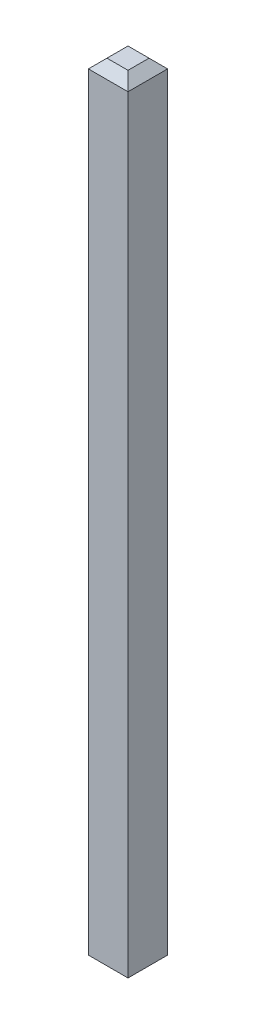
ISO-10303-21;
HEADER;
FILE_DESCRIPTION(('STEP AP214'),'2;1');
FILE_NAME('part.step','',(''),(''),'','','');
FILE_SCHEMA(('AUTOMOTIVE_DESIGN { 1 0 10303 214 1 1 1 1 }'));
ENDSEC;
DATA;
#1=APPLICATION_CONTEXT('core data for automotive mechanical design processes');
#2=APPLICATION_PROTOCOL_DEFINITION('international standard','automotive_design',2000,#1);
#3=PRODUCT_CONTEXT('',#1,'mechanical');
#4=PRODUCT('Part','Part','',(#3));
#5=PRODUCT_RELATED_PRODUCT_CATEGORY('part','',(#4));
#6=PRODUCT_DEFINITION_FORMATION('','',#4);
#7=PRODUCT_DEFINITION_CONTEXT('part definition',#1,'design');
#8=PRODUCT_DEFINITION('design','',#6,#7);
#9=PRODUCT_DEFINITION_SHAPE('','',#8);
#10=(LENGTH_UNIT() NAMED_UNIT(*) SI_UNIT(.MILLI.,.METRE.));
#11=(NAMED_UNIT(*) PLANE_ANGLE_UNIT() SI_UNIT($,.RADIAN.));
#12=(NAMED_UNIT(*) SI_UNIT($,.STERADIAN.) SOLID_ANGLE_UNIT());
#13=UNCERTAINTY_MEASURE_WITH_UNIT(LENGTH_MEASURE(1.E-05),#10,'distance_accuracy_value','');
#14=(GEOMETRIC_REPRESENTATION_CONTEXT(3) GLOBAL_UNCERTAINTY_ASSIGNED_CONTEXT((#13)) GLOBAL_UNIT_ASSIGNED_CONTEXT((#10,
#11,#12)) REPRESENTATION_CONTEXT('',''));
#15=CARTESIAN_POINT('',(0.,0.,0.));
#16=DIRECTION('',(0.,0.,1.));
#17=DIRECTION('',(1.,0.,0.));
#18=AXIS2_PLACEMENT_3D('',#15,#16,#17);
#19=CARTESIAN_POINT('',(0.16,-1.925,-0.245));
#20=DIRECTION('',(0.,-0.707106781186547,-0.707106781186548));
#21=DIRECTION('',(0.,0.707106781186548,-0.707106781186547));
#22=AXIS2_PLACEMENT_3D('',#19,#20,#21);
#23=PLANE('',#22);
#24=DIRECTION('',(-1.,0.,0.));
#25=VECTOR('',#24,1.);
#26=CARTESIAN_POINT('',(0.32,-1.85,-0.32));
#27=LINE('',#26,#25);
#28=CARTESIAN_POINT('',(0.32,-1.85,-0.32));
#29=VERTEX_POINT('',#28);
#30=CARTESIAN_POINT('',(-0.32,-1.85,-0.32));
#31=VERTEX_POINT('',#30);
#32=EDGE_CURVE('E96',#29,#31,#27,.T.);
#33=ORIENTED_EDGE('',*,*,#32,.F.);
#34=DIRECTION('',(0.577350269189625,0.577350269189626,-0.577350269189626));
#35=VECTOR('',#34,1.);
#36=CARTESIAN_POINT('',(0.17,-2.,-0.17));
#37=LINE('',#36,#35);
#38=CARTESIAN_POINT('',(0.17,-2.,-0.17));
#39=VERTEX_POINT('',#38);
#40=EDGE_CURVE('E94',#39,#29,#37,.T.);
#41=ORIENTED_EDGE('',*,*,#40,.F.);
#42=DIRECTION('',(1.,0.,0.));
#43=VECTOR('',#42,1.);
#44=CARTESIAN_POINT('',(0.,-2.,-0.17));
#45=LINE('',#44,#43);
#46=CARTESIAN_POINT('',(-0.17,-2.,-0.17));
#47=VERTEX_POINT('',#46);
#48=EDGE_CURVE('E20',#39,#47,#45,.F.);
#49=ORIENTED_EDGE('',*,*,#48,.T.);
#50=DIRECTION('',(0.577350269189625,-0.577350269189626,0.577350269189626));
#51=VECTOR('',#50,1.);
#52=CARTESIAN_POINT('',(-0.32,-1.85,-0.32));
#53=LINE('',#52,#51);
#54=EDGE_CURVE('E112',#31,#47,#53,.T.);
#55=ORIENTED_EDGE('',*,*,#54,.F.);
#56=EDGE_LOOP('',(#33,#41,#49,#55));
#57=FACE_BOUND('',#56,.T.);
#58=ADVANCED_FACE('F17',(#57),#23,.T.);
#59=CARTESIAN_POINT('',(0.16,10.625,-0.245));
#60=DIRECTION('',(0.,0.70710678118655,-0.707106781186545));
#61=DIRECTION('',(0.,0.707106781186545,0.70710678118655));
#62=AXIS2_PLACEMENT_3D('',#59,#60,#61);
#63=PLANE('',#62);
#64=DIRECTION('',(-1.,0.,0.));
#65=VECTOR('',#64,1.);
#66=CARTESIAN_POINT('',(0.32,10.55,-0.32));
#67=LINE('',#66,#65);
#68=CARTESIAN_POINT('',(-0.32,10.55,-0.32));
#69=VERTEX_POINT('',#68);
#70=CARTESIAN_POINT('',(0.32,10.55,-0.32));
#71=VERTEX_POINT('',#70);
#72=EDGE_CURVE('E121',#69,#71,#67,.F.);
#73=ORIENTED_EDGE('',*,*,#72,.F.);
#74=DIRECTION('',(-0.577350269189627,-0.577350269189623,-0.577350269189627));
#75=VECTOR('',#74,1.);
#76=CARTESIAN_POINT('',(-0.170000000000001,10.7,-0.17));
#77=LINE('',#76,#75);
#78=CARTESIAN_POINT('',(-0.17,10.7,-0.17));
#79=VERTEX_POINT('',#78);
#80=EDGE_CURVE('E118',#79,#69,#77,.T.);
#81=ORIENTED_EDGE('',*,*,#80,.F.);
#82=DIRECTION('',(1.,0.,0.));
#83=VECTOR('',#82,1.);
#84=CARTESIAN_POINT('',(0.,10.7,-0.17));
#85=LINE('',#84,#83);
#86=CARTESIAN_POINT('',(0.17,10.7,-0.17));
#87=VERTEX_POINT('',#86);
#88=EDGE_CURVE('E79',#87,#79,#85,.F.);
#89=ORIENTED_EDGE('',*,*,#88,.F.);
#90=DIRECTION('',(-0.577350269189627,0.577350269189623,0.577350269189627));
#91=VECTOR('',#90,1.);
#92=CARTESIAN_POINT('',(0.320000000000001,10.55,-0.32));
#93=LINE('',#92,#91);
#94=EDGE_CURVE('E109',#71,#87,#93,.T.);
#95=ORIENTED_EDGE('',*,*,#94,.F.);
#96=EDGE_LOOP('',(#73,#81,#89,#95));
#97=FACE_BOUND('',#96,.T.);
#98=ADVANCED_FACE('F283',(#97),#63,.T.);
#99=CARTESIAN_POINT('',(0.,-2.,0.));
#100=DIRECTION('',(0.,1.,0.));
#101=DIRECTION('',(0.,0.,1.));
#102=AXIS2_PLACEMENT_3D('',#99,#100,#101);
#103=PLANE('',#102);
#104=DIRECTION('',(1.,0.,0.));
#105=VECTOR('',#104,1.);
#106=CARTESIAN_POINT('',(-0.16,-2.,0.17));
#107=LINE('',#106,#105);
#108=CARTESIAN_POINT('',(-0.17,-2.,0.17));
#109=VERTEX_POINT('',#108);
#110=CARTESIAN_POINT('',(0.17,-2.,0.17));
#111=VERTEX_POINT('',#110);
#112=EDGE_CURVE('E124',#109,#111,#107,.T.);
#113=ORIENTED_EDGE('',*,*,#112,.F.);
#114=DIRECTION('',(0.,0.,1.));
#115=VECTOR('',#114,1.);
#116=CARTESIAN_POINT('',(-0.17,-2.,-0.16));
#117=LINE('',#116,#115);
#118=EDGE_CURVE('E90',#47,#109,#117,.T.);
#119=ORIENTED_EDGE('',*,*,#118,.F.);
#120=ORIENTED_EDGE('',*,*,#48,.F.);
#121=DIRECTION('',(0.,0.,1.));
#122=VECTOR('',#121,1.);
#123=CARTESIAN_POINT('',(0.17,-2.,0.16));
#124=LINE('',#123,#122);
#125=EDGE_CURVE('E87',#111,#39,#124,.F.);
#126=ORIENTED_EDGE('',*,*,#125,.F.);
#127=EDGE_LOOP('',(#113,#119,#120,#126));
#128=FACE_BOUND('',#127,.T.);
#129=ADVANCED_FACE('F85',(#128),#103,.F.);
#130=CARTESIAN_POINT('',(0.245,-1.925,0.16));
#131=DIRECTION('',(0.707106781186548,-0.707106781186547,0.));
#132=DIRECTION('',(0.707106781186547,0.707106781186548,0.));
#133=AXIS2_PLACEMENT_3D('',#130,#131,#132);
#134=PLANE('',#133);
#135=DIRECTION('',(0.,0.,-1.));
#136=VECTOR('',#135,1.);
#137=CARTESIAN_POINT('',(0.32,-1.85,0.32));
#138=LINE('',#137,#136);
#139=CARTESIAN_POINT('',(0.32,-1.85,0.32));
#140=VERTEX_POINT('',#139);
#141=EDGE_CURVE('E130',#140,#29,#138,.T.);
#142=ORIENTED_EDGE('',*,*,#141,.F.);
#143=DIRECTION('',(0.577350269189626,0.577350269189626,0.577350269189625));
#144=VECTOR('',#143,1.);
#145=CARTESIAN_POINT('',(0.17,-2.,0.17));
#146=LINE('',#145,#144);
#147=EDGE_CURVE('E102',#111,#140,#146,.T.);
#148=ORIENTED_EDGE('',*,*,#147,.F.);
#149=ORIENTED_EDGE('',*,*,#125,.T.);
#150=ORIENTED_EDGE('',*,*,#40,.T.);
#151=EDGE_LOOP('',(#142,#148,#149,#150));
#152=FACE_BOUND('',#151,.T.);
#153=ADVANCED_FACE('F100',(#152),#134,.T.);
#154=CARTESIAN_POINT('',(0.,10.7,0.));
#155=DIRECTION('',(0.,1.,0.));
#156=DIRECTION('',(0.,0.,1.));
#157=AXIS2_PLACEMENT_3D('',#154,#155,#156);
#158=PLANE('',#157);
#159=DIRECTION('',(1.,0.,0.));
#160=VECTOR('',#159,1.);
#161=CARTESIAN_POINT('',(-0.16,10.7,0.170000000000001));
#162=LINE('',#161,#160);
#163=CARTESIAN_POINT('',(0.17,10.7,0.17));
#164=VERTEX_POINT('',#163);
#165=CARTESIAN_POINT('',(-0.17,10.7,0.17));
#166=VERTEX_POINT('',#165);
#167=EDGE_CURVE('E139',#164,#166,#162,.F.);
#168=ORIENTED_EDGE('',*,*,#167,.F.);
#169=DIRECTION('',(0.,0.,1.));
#170=VECTOR('',#169,1.);
#171=CARTESIAN_POINT('',(0.170000000000001,10.7,0.16));
#172=LINE('',#171,#170);
#173=EDGE_CURVE('E106',#87,#164,#172,.T.);
#174=ORIENTED_EDGE('',*,*,#173,.F.);
#175=ORIENTED_EDGE('',*,*,#88,.T.);
#176=DIRECTION('',(0.,0.,1.));
#177=VECTOR('',#176,1.);
#178=CARTESIAN_POINT('',(-0.170000000000001,10.7,-0.16));
#179=LINE('',#178,#177);
#180=EDGE_CURVE('E115',#166,#79,#179,.F.);
#181=ORIENTED_EDGE('',*,*,#180,.F.);
#182=EDGE_LOOP('',(#168,#174,#175,#181));
#183=FACE_BOUND('',#182,.T.);
#184=ADVANCED_FACE('F259',(#183),#158,.T.);
#185=CARTESIAN_POINT('',(0.245,10.625,0.16));
#186=DIRECTION('',(0.707106781186545,0.70710678118655,0.));
#187=DIRECTION('',(-0.70710678118655,0.707106781186545,0.));
#188=AXIS2_PLACEMENT_3D('',#185,#186,#187);
#189=PLANE('',#188);
#190=DIRECTION('',(0.,0.,-1.));
#191=VECTOR('',#190,1.);
#192=CARTESIAN_POINT('',(0.32,10.55,0.32));
#193=LINE('',#192,#191);
#194=CARTESIAN_POINT('',(0.32,10.55,0.32));
#195=VERTEX_POINT('',#194);
#196=EDGE_CURVE('E136',#71,#195,#193,.F.);
#197=ORIENTED_EDGE('',*,*,#196,.F.);
#198=ORIENTED_EDGE('',*,*,#94,.T.);
#199=ORIENTED_EDGE('',*,*,#173,.T.);
#200=DIRECTION('',(-0.577350269189627,0.577350269189623,-0.577350269189627));
#201=VECTOR('',#200,1.);
#202=CARTESIAN_POINT('',(0.32,10.55,0.320000000000001));
#203=LINE('',#202,#201);
#204=EDGE_CURVE('E144',#195,#164,#203,.T.);
#205=ORIENTED_EDGE('',*,*,#204,.F.);
#206=EDGE_LOOP('',(#197,#198,#199,#205));
#207=FACE_BOUND('',#206,.T.);
#208=ADVANCED_FACE('F251',(#207),#189,.T.);
#209=CARTESIAN_POINT('',(-0.245,-1.925,-0.16));
#210=DIRECTION('',(-0.707106781186548,-0.707106781186547,0.));
#211=DIRECTION('',(0.707106781186547,-0.707106781186548,0.));
#212=AXIS2_PLACEMENT_3D('',#209,#210,#211);
#213=PLANE('',#212);
#214=ORIENTED_EDGE('',*,*,#118,.T.);
#215=DIRECTION('',(0.577350269189626,-0.577350269189626,-0.577350269189625));
#216=VECTOR('',#215,1.);
#217=CARTESIAN_POINT('',(-0.32,-1.85,0.32));
#218=LINE('',#217,#216);
#219=CARTESIAN_POINT('',(-0.32,-1.85,0.32));
#220=VERTEX_POINT('',#219);
#221=EDGE_CURVE('E127',#220,#109,#218,.T.);
#222=ORIENTED_EDGE('',*,*,#221,.F.);
#223=DIRECTION('',(0.,0.,1.));
#224=VECTOR('',#223,1.);
#225=CARTESIAN_POINT('',(-0.32,-1.85,-0.32));
#226=LINE('',#225,#224);
#227=EDGE_CURVE('E147',#31,#220,#226,.T.);
#228=ORIENTED_EDGE('',*,*,#227,.F.);
#229=ORIENTED_EDGE('',*,*,#54,.T.);
#230=EDGE_LOOP('',(#214,#222,#228,#229));
#231=FACE_BOUND('',#230,.T.);
#232=ADVANCED_FACE('F173',(#231),#213,.T.);
#233=CARTESIAN_POINT('',(-0.245,10.625,-0.16));
#234=DIRECTION('',(-0.707106781186545,0.70710678118655,0.));
#235=DIRECTION('',(-0.70710678118655,-0.707106781186545,0.));
#236=AXIS2_PLACEMENT_3D('',#233,#234,#235);
#237=PLANE('',#236);
#238=ORIENTED_EDGE('',*,*,#180,.T.);
#239=ORIENTED_EDGE('',*,*,#80,.T.);
#240=DIRECTION('',(0.,0.,1.));
#241=VECTOR('',#240,1.);
#242=CARTESIAN_POINT('',(-0.32,10.55,-0.32));
#243=LINE('',#242,#241);
#244=CARTESIAN_POINT('',(-0.32,10.55,0.32));
#245=VERTEX_POINT('',#244);
#246=EDGE_CURVE('E35',#245,#69,#243,.F.);
#247=ORIENTED_EDGE('',*,*,#246,.F.);
#248=DIRECTION('',(-0.577350269189627,-0.577350269189623,0.577350269189627));
#249=VECTOR('',#248,1.);
#250=CARTESIAN_POINT('',(-0.17,10.7,0.170000000000001));
#251=LINE('',#250,#249);
#252=EDGE_CURVE('E142',#166,#245,#251,.T.);
#253=ORIENTED_EDGE('',*,*,#252,.F.);
#254=EDGE_LOOP('',(#238,#239,#247,#253));
#255=FACE_BOUND('',#254,.T.);
#256=ADVANCED_FACE('F190',(#255),#237,.T.);
#257=CARTESIAN_POINT('',(0.32,-2.,-0.32));
#258=DIRECTION('',(0.,0.,-1.));
#259=DIRECTION('',(-1.,0.,0.));
#260=AXIS2_PLACEMENT_3D('',#257,#258,#259);
#261=PLANE('',#260);
#262=ORIENTED_EDGE('',*,*,#72,.T.);
#263=DIRECTION('',(0.,1.,0.));
#264=VECTOR('',#263,1.);
#265=CARTESIAN_POINT('',(0.32,-2.,-0.32));
#266=LINE('',#265,#264);
#267=EDGE_CURVE('E133',#29,#71,#266,.T.);
#268=ORIENTED_EDGE('',*,*,#267,.F.);
#269=ORIENTED_EDGE('',*,*,#32,.T.);
#270=DIRECTION('',(0.,1.,0.));
#271=VECTOR('',#270,1.);
#272=CARTESIAN_POINT('',(-0.32,-2.,-0.32));
#273=LINE('',#272,#271);
#274=EDGE_CURVE('E151',#69,#31,#273,.F.);
#275=ORIENTED_EDGE('',*,*,#274,.F.);
#276=EDGE_LOOP('',(#262,#268,#269,#275));
#277=FACE_BOUND('',#276,.T.);
#278=ADVANCED_FACE('F176',(#277),#261,.T.);
#279=CARTESIAN_POINT('',(-0.16,-1.925,0.245));
#280=DIRECTION('',(0.,-0.707106781186547,0.707106781186548));
#281=DIRECTION('',(0.,-0.707106781186548,-0.707106781186547));
#282=AXIS2_PLACEMENT_3D('',#279,#280,#281);
#283=PLANE('',#282);
#284=DIRECTION('',(1.,0.,0.));
#285=VECTOR('',#284,1.);
#286=CARTESIAN_POINT('',(-0.32,-1.85,0.32));
#287=LINE('',#286,#285);
#288=EDGE_CURVE('E154',#220,#140,#287,.T.);
#289=ORIENTED_EDGE('',*,*,#288,.F.);
#290=ORIENTED_EDGE('',*,*,#221,.T.);
#291=ORIENTED_EDGE('',*,*,#112,.T.);
#292=ORIENTED_EDGE('',*,*,#147,.T.);
#293=EDGE_LOOP('',(#289,#290,#291,#292));
#294=FACE_BOUND('',#293,.T.);
#295=ADVANCED_FACE('F181',(#294),#283,.T.);
#296=CARTESIAN_POINT('',(0.32,-2.,0.32));
#297=DIRECTION('',(1.,0.,0.));
#298=DIRECTION('',(0.,0.,-1.));
#299=AXIS2_PLACEMENT_3D('',#296,#297,#298);
#300=PLANE('',#299);
#301=ORIENTED_EDGE('',*,*,#196,.T.);
#302=DIRECTION('',(0.,1.,0.));
#303=VECTOR('',#302,1.);
#304=CARTESIAN_POINT('',(0.32,-2.,0.32));
#305=LINE('',#304,#303);
#306=EDGE_CURVE('E157',#140,#195,#305,.T.);
#307=ORIENTED_EDGE('',*,*,#306,.F.);
#308=ORIENTED_EDGE('',*,*,#141,.T.);
#309=ORIENTED_EDGE('',*,*,#267,.T.);
#310=EDGE_LOOP('',(#301,#307,#308,#309));
#311=FACE_BOUND('',#310,.T.);
#312=ADVANCED_FACE('F179',(#311),#300,.T.);
#313=CARTESIAN_POINT('',(-0.16,10.625,0.245));
#314=DIRECTION('',(0.,0.70710678118655,0.707106781186545));
#315=DIRECTION('',(0.,-0.707106781186545,0.70710678118655));
#316=AXIS2_PLACEMENT_3D('',#313,#314,#315);
#317=PLANE('',#316);
#318=DIRECTION('',(1.,0.,0.));
#319=VECTOR('',#318,1.);
#320=CARTESIAN_POINT('',(-0.32,10.55,0.32));
#321=LINE('',#320,#319);
#322=EDGE_CURVE('E26',#195,#245,#321,.F.);
#323=ORIENTED_EDGE('',*,*,#322,.F.);
#324=ORIENTED_EDGE('',*,*,#204,.T.);
#325=ORIENTED_EDGE('',*,*,#167,.T.);
#326=ORIENTED_EDGE('',*,*,#252,.T.);
#327=EDGE_LOOP('',(#323,#324,#325,#326));
#328=FACE_BOUND('',#327,.T.);
#329=ADVANCED_FACE('F167',(#328),#317,.T.);
#330=CARTESIAN_POINT('',(-0.32,-2.,-0.32));
#331=DIRECTION('',(-1.,0.,0.));
#332=DIRECTION('',(0.,0.,1.));
#333=AXIS2_PLACEMENT_3D('',#330,#331,#332);
#334=PLANE('',#333);
#335=ORIENTED_EDGE('',*,*,#246,.T.);
#336=ORIENTED_EDGE('',*,*,#274,.T.);
#337=ORIENTED_EDGE('',*,*,#227,.T.);
#338=DIRECTION('',(0.,1.,0.));
#339=VECTOR('',#338,1.);
#340=CARTESIAN_POINT('',(-0.32,-2.,0.32));
#341=LINE('',#340,#339);
#342=EDGE_CURVE('E11',#245,#220,#341,.F.);
#343=ORIENTED_EDGE('',*,*,#342,.F.);
#344=EDGE_LOOP('',(#335,#336,#337,#343));
#345=FACE_BOUND('',#344,.T.);
#346=ADVANCED_FACE('F169',(#345),#334,.T.);
#347=CARTESIAN_POINT('',(-0.32,-2.,0.32));
#348=DIRECTION('',(0.,0.,1.));
#349=DIRECTION('',(1.,0.,0.));
#350=AXIS2_PLACEMENT_3D('',#347,#348,#349);
#351=PLANE('',#350);
#352=ORIENTED_EDGE('',*,*,#322,.T.);
#353=ORIENTED_EDGE('',*,*,#342,.T.);
#354=ORIENTED_EDGE('',*,*,#288,.T.);
#355=ORIENTED_EDGE('',*,*,#306,.T.);
#356=EDGE_LOOP('',(#352,#353,#354,#355));
#357=FACE_BOUND('',#356,.T.);
#358=ADVANCED_FACE('F163',(#357),#351,.T.);
#359=CLOSED_SHELL('',(#58,#98,#129,#153,#184,#208,#232,#256,#278,#295,#312,#329,#346,#358));
#360=MANIFOLD_SOLID_BREP('B1',#359);
#361=ADVANCED_BREP_SHAPE_REPRESENTATION('',(#18,#360),#14);
#362=SHAPE_DEFINITION_REPRESENTATION(#9,#361);
ENDSEC;
END-ISO-10303-21;
